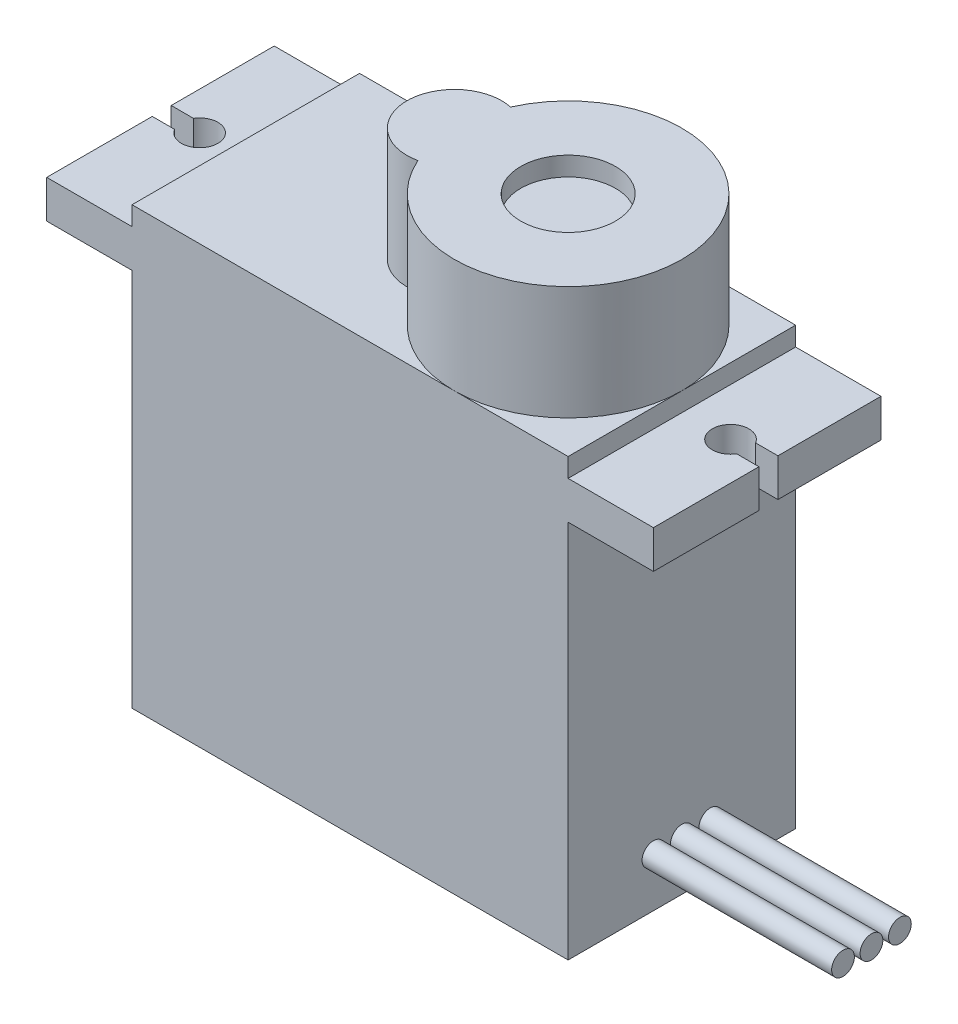
ISO-10303-21;
HEADER;
FILE_DESCRIPTION(('STEP AP214'),'2;1');
FILE_NAME('part.step','',(''),(''),'','','');
FILE_SCHEMA(('AUTOMOTIVE_DESIGN { 1 0 10303 214 1 1 1 1 }'));
ENDSEC;
DATA;
#1=APPLICATION_CONTEXT('core data for automotive mechanical design processes');
#2=APPLICATION_PROTOCOL_DEFINITION('international standard','automotive_design',2000,#1);
#3=PRODUCT_CONTEXT('',#1,'mechanical');
#4=PRODUCT('Part','Part','',(#3));
#5=PRODUCT_RELATED_PRODUCT_CATEGORY('part','',(#4));
#6=PRODUCT_DEFINITION_FORMATION('','',#4);
#7=PRODUCT_DEFINITION_CONTEXT('part definition',#1,'design');
#8=PRODUCT_DEFINITION('design','',#6,#7);
#9=PRODUCT_DEFINITION_SHAPE('','',#8);
#10=(LENGTH_UNIT() NAMED_UNIT(*) SI_UNIT(.MILLI.,.METRE.));
#11=(NAMED_UNIT(*) PLANE_ANGLE_UNIT() SI_UNIT($,.RADIAN.));
#12=(NAMED_UNIT(*) SI_UNIT($,.STERADIAN.) SOLID_ANGLE_UNIT());
#13=UNCERTAINTY_MEASURE_WITH_UNIT(LENGTH_MEASURE(1.E-05),#10,'distance_accuracy_value','');
#14=(GEOMETRIC_REPRESENTATION_CONTEXT(3) GLOBAL_UNCERTAINTY_ASSIGNED_CONTEXT((#13)) GLOBAL_UNIT_ASSIGNED_CONTEXT((#10,
#11,#12)) REPRESENTATION_CONTEXT('',''));
#15=CARTESIAN_POINT('',(0.,0.,0.));
#16=DIRECTION('',(0.,0.,1.));
#17=DIRECTION('',(1.,0.,0.));
#18=AXIS2_PLACEMENT_3D('',#15,#16,#17);
#19=CARTESIAN_POINT('',(16.,10.5,12.));
#20=DIRECTION('',(-1.,0.,0.));
#21=DIRECTION('',(0.,-1.,0.));
#22=AXIS2_PLACEMENT_3D('',#19,#20,#21);
#23=PLANE('',#22);
#24=DIRECTION('',(0.,0.,-1.));
#25=VECTOR('',#24,1.);
#26=CARTESIAN_POINT('',(16.,8.5,12.));
#27=LINE('',#26,#25);
#28=CARTESIAN_POINT('',(16.,8.5,12.));
#29=VERTEX_POINT('',#28);
#30=CARTESIAN_POINT('',(16.,8.5,6.43335559913665));
#31=VERTEX_POINT('',#30);
#32=EDGE_CURVE('E244',#29,#31,#27,.T.);
#33=ORIENTED_EDGE('',*,*,#32,.T.);
#34=DIRECTION('',(0.,1.,0.));
#35=VECTOR('',#34,1.);
#36=CARTESIAN_POINT('',(16.,5.5,6.43335559913665));
#37=LINE('',#36,#35);
#38=CARTESIAN_POINT('',(16.,10.5,6.43335559913665));
#39=VERTEX_POINT('',#38);
#40=EDGE_CURVE('E216',#31,#39,#37,.T.);
#41=ORIENTED_EDGE('',*,*,#40,.T.);
#42=DIRECTION('',(0.,0.,-1.));
#43=VECTOR('',#42,1.);
#44=CARTESIAN_POINT('',(16.,10.5,12.));
#45=LINE('',#44,#43);
#46=CARTESIAN_POINT('',(16.,10.5,12.));
#47=VERTEX_POINT('',#46);
#48=EDGE_CURVE('E240',#47,#39,#45,.T.);
#49=ORIENTED_EDGE('',*,*,#48,.F.);
#50=DIRECTION('',(0.,1.,0.));
#51=VECTOR('',#50,1.);
#52=CARTESIAN_POINT('',(16.,10.5,12.));
#53=LINE('',#52,#51);
#54=EDGE_CURVE('E354',#29,#47,#53,.T.);
#55=ORIENTED_EDGE('',*,*,#54,.F.);
#56=EDGE_LOOP('',(#33,#41,#49,#55));
#57=FACE_BOUND('',#56,.T.);
#58=ADVANCED_FACE('F36',(#57),#23,.F.);
#59=CARTESIAN_POINT('',(-16.,10.5,12.));
#60=DIRECTION('',(1.,0.,0.));
#61=DIRECTION('',(0.,1.,0.));
#62=AXIS2_PLACEMENT_3D('',#59,#60,#61);
#63=PLANE('',#62);
#64=DIRECTION('',(0.,0.,-1.));
#65=VECTOR('',#64,1.);
#66=CARTESIAN_POINT('',(-16.,8.5,12.));
#67=LINE('',#66,#65);
#68=CARTESIAN_POINT('',(-16.,8.5,5.43335559913665));
#69=VERTEX_POINT('',#68);
#70=CARTESIAN_POINT('',(-16.,8.5,0.));
#71=VERTEX_POINT('',#70);
#72=EDGE_CURVE('E327',#69,#71,#67,.T.);
#73=ORIENTED_EDGE('',*,*,#72,.F.);
#74=DIRECTION('',(0.,1.,0.));
#75=VECTOR('',#74,1.);
#76=CARTESIAN_POINT('',(-16.,5.49999999999999,5.43335559913665));
#77=LINE('',#76,#75);
#78=CARTESIAN_POINT('',(-16.,10.5,5.43335559913665));
#79=VERTEX_POINT('',#78);
#80=EDGE_CURVE('E382',#69,#79,#77,.T.);
#81=ORIENTED_EDGE('',*,*,#80,.T.);
#82=DIRECTION('',(0.,0.,-1.));
#83=VECTOR('',#82,1.);
#84=CARTESIAN_POINT('',(-16.,10.5,12.));
#85=LINE('',#84,#83);
#86=CARTESIAN_POINT('',(-16.,10.5,0.));
#87=VERTEX_POINT('',#86);
#88=EDGE_CURVE('E221',#79,#87,#85,.T.);
#89=ORIENTED_EDGE('',*,*,#88,.T.);
#90=DIRECTION('',(0.,-1.,0.));
#91=VECTOR('',#90,1.);
#92=CARTESIAN_POINT('',(-16.,10.5,0.));
#93=LINE('',#92,#91);
#94=EDGE_CURVE('E312',#87,#71,#93,.T.);
#95=ORIENTED_EDGE('',*,*,#94,.T.);
#96=EDGE_LOOP('',(#73,#81,#89,#95));
#97=FACE_BOUND('',#96,.T.);
#98=ADVANCED_FACE('F475',(#97),#63,.F.);
#99=CARTESIAN_POINT('',(-11.5,11.5,12.));
#100=DIRECTION('',(0.,-1.,0.));
#101=DIRECTION('',(0.,0.,-1.));
#102=AXIS2_PLACEMENT_3D('',#99,#100,#101);
#103=PLANE('',#102);
#104=CARTESIAN_POINT('',(-0.499999999999998,11.5,6.));
#105=DIRECTION('',(0.,1.,0.));
#106=DIRECTION('',(0.,0.,1.));
#107=AXIS2_PLACEMENT_3D('',#104,#105,#106);
#108=CIRCLE('',#107,2.5);
#109=CARTESIAN_POINT('',(0.0208333333333371,11.5,3.55485529285301));
#110=VERTEX_POINT('',#109);
#111=CARTESIAN_POINT('',(0.0208333333333336,11.5,8.44514470714698));
#112=VERTEX_POINT('',#111);
#113=EDGE_CURVE('E367',#110,#112,#108,.T.);
#114=ORIENTED_EDGE('',*,*,#113,.F.);
#115=CARTESIAN_POINT('',(5.50000000000001,11.5,6.));
#116=DIRECTION('',(0.,1.,0.));
#117=DIRECTION('',(0.,0.,1.));
#118=AXIS2_PLACEMENT_3D('',#115,#116,#117);
#119=CIRCLE('',#118,6.);
#120=CARTESIAN_POINT('',(5.50000000000001,11.5,0.));
#121=VERTEX_POINT('',#120);
#122=EDGE_CURVE('E250',#121,#110,#119,.T.);
#123=ORIENTED_EDGE('',*,*,#122,.F.);
#124=DIRECTION('',(-1.,0.,0.));
#125=VECTOR('',#124,1.);
#126=CARTESIAN_POINT('',(-11.5,11.5,0.));
#127=LINE('',#126,#125);
#128=CARTESIAN_POINT('',(-11.5,11.5,0.));
#129=VERTEX_POINT('',#128);
#130=EDGE_CURVE('E303',#121,#129,#127,.T.);
#131=ORIENTED_EDGE('',*,*,#130,.T.);
#132=DIRECTION('',(0.,0.,-1.));
#133=VECTOR('',#132,1.);
#134=CARTESIAN_POINT('',(-11.5,11.5,12.));
#135=LINE('',#134,#133);
#136=CARTESIAN_POINT('',(-11.5,11.5,12.));
#137=VERTEX_POINT('',#136);
#138=EDGE_CURVE('E224',#137,#129,#135,.T.);
#139=ORIENTED_EDGE('',*,*,#138,.F.);
#140=DIRECTION('',(-1.,0.,0.));
#141=VECTOR('',#140,1.);
#142=CARTESIAN_POINT('',(-11.5,11.5,12.));
#143=LINE('',#142,#141);
#144=CARTESIAN_POINT('',(5.50000000000001,11.5,12.));
#145=VERTEX_POINT('',#144);
#146=EDGE_CURVE('E349',#145,#137,#143,.T.);
#147=ORIENTED_EDGE('',*,*,#146,.F.);
#148=EDGE_CURVE('E363',#112,#145,#119,.T.);
#149=ORIENTED_EDGE('',*,*,#148,.F.);
#150=EDGE_LOOP('',(#114,#123,#131,#139,#147,#149));
#151=FACE_BOUND('',#150,.T.);
#152=ADVANCED_FACE('F452',(#151),#103,.F.);
#153=CARTESIAN_POINT('',(11.5,11.5,6.));
#154=VERTEX_POINT('',#153);
#155=EDGE_CURVE('E253',#145,#154,#119,.T.);
#156=ORIENTED_EDGE('',*,*,#155,.F.);
#157=CARTESIAN_POINT('',(11.5,11.5,12.));
#158=VERTEX_POINT('',#157);
#159=EDGE_CURVE('E346',#158,#145,#143,.T.);
#160=ORIENTED_EDGE('',*,*,#159,.F.);
#161=DIRECTION('',(0.,0.,-1.));
#162=VECTOR('',#161,1.);
#163=CARTESIAN_POINT('',(11.5,11.5,12.));
#164=LINE('',#163,#162);
#165=EDGE_CURVE('E233',#158,#154,#164,.T.);
#166=ORIENTED_EDGE('',*,*,#165,.T.);
#167=EDGE_LOOP('',(#156,#160,#166));
#168=FACE_BOUND('',#167,.T.);
#169=ADVANCED_FACE('F269',(#168),#103,.F.);
#170=CARTESIAN_POINT('',(11.5,8.5,12.));
#171=DIRECTION('',(-1.,0.,0.));
#172=DIRECTION('',(0.,-1.,0.));
#173=AXIS2_PLACEMENT_3D('',#170,#171,#172);
#174=PLANE('',#173);
#175=CARTESIAN_POINT('',(11.5,-8.9,4.5));
#176=DIRECTION('',(-1.,0.,0.));
#177=DIRECTION('',(0.,-1.,0.));
#178=AXIS2_PLACEMENT_3D('',#175,#176,#177);
#179=CIRCLE('',#178,0.6);
#180=CARTESIAN_POINT('',(11.5,-9.5,4.5));
#181=VERTEX_POINT('',#180);
#182=EDGE_CURVE('E11',#181,#181,#179,.F.);
#183=ORIENTED_EDGE('',*,*,#182,.F.);
#184=EDGE_LOOP('',(#183));
#185=FACE_BOUND('',#184,.T.);
#186=CARTESIAN_POINT('',(11.5,-8.9,7.5));
#187=DIRECTION('',(-1.,0.,0.));
#188=DIRECTION('',(0.,-1.,0.));
#189=AXIS2_PLACEMENT_3D('',#186,#187,#188);
#190=CIRCLE('',#189,0.6);
#191=CARTESIAN_POINT('',(11.5,-9.5,7.5));
#192=VERTEX_POINT('',#191);
#193=EDGE_CURVE('E44',#192,#192,#190,.F.);
#194=ORIENTED_EDGE('',*,*,#193,.F.);
#195=EDGE_LOOP('',(#194));
#196=FACE_BOUND('',#195,.T.);
#197=CARTESIAN_POINT('',(11.5,-8.9,6.));
#198=DIRECTION('',(-1.,0.,0.));
#199=DIRECTION('',(0.,-1.,0.));
#200=AXIS2_PLACEMENT_3D('',#197,#198,#199);
#201=CIRCLE('',#200,0.6);
#202=CARTESIAN_POINT('',(11.5,-9.5,6.));
#203=VERTEX_POINT('',#202);
#204=EDGE_CURVE('E259',#203,#203,#201,.F.);
#205=ORIENTED_EDGE('',*,*,#204,.F.);
#206=EDGE_LOOP('',(#205));
#207=FACE_BOUND('',#206,.T.);
#208=DIRECTION('',(0.,1.,0.));
#209=VECTOR('',#208,1.);
#210=CARTESIAN_POINT('',(11.5,8.5,0.));
#211=LINE('',#210,#209);
#212=CARTESIAN_POINT('',(11.5,-11.5,0.));
#213=VERTEX_POINT('',#212);
#214=CARTESIAN_POINT('',(11.5,8.5,0.));
#215=VERTEX_POINT('',#214);
#216=EDGE_CURVE('E277',#213,#215,#211,.T.);
#217=ORIENTED_EDGE('',*,*,#216,.T.);
#218=DIRECTION('',(0.,0.,-1.));
#219=VECTOR('',#218,1.);
#220=CARTESIAN_POINT('',(11.5,8.5,12.));
#221=LINE('',#220,#219);
#222=CARTESIAN_POINT('',(11.5,8.5,12.));
#223=VERTEX_POINT('',#222);
#224=EDGE_CURVE('E247',#223,#215,#221,.T.);
#225=ORIENTED_EDGE('',*,*,#224,.F.);
#226=DIRECTION('',(0.,1.,0.));
#227=VECTOR('',#226,1.);
#228=CARTESIAN_POINT('',(11.5,8.5,12.));
#229=LINE('',#228,#227);
#230=CARTESIAN_POINT('',(11.5,-11.5,12.));
#231=VERTEX_POINT('',#230);
#232=EDGE_CURVE('E321',#231,#223,#229,.T.);
#233=ORIENTED_EDGE('',*,*,#232,.F.);
#234=DIRECTION('',(0.,0.,-1.));
#235=VECTOR('',#234,1.);
#236=CARTESIAN_POINT('',(11.5,-11.5,12.));
#237=LINE('',#236,#235);
#238=EDGE_CURVE('E280',#231,#213,#237,.T.);
#239=ORIENTED_EDGE('',*,*,#238,.T.);
#240=EDGE_LOOP('',(#217,#225,#233,#239));
#241=FACE_BOUND('',#240,.T.);
#242=ADVANCED_FACE('F38',(#185,#196,#207,#241),#174,.F.);
#243=CARTESIAN_POINT('',(11.5,8.5,12.));
#244=DIRECTION('',(0.,1.,0.));
#245=DIRECTION('',(0.,0.,1.));
#246=AXIS2_PLACEMENT_3D('',#243,#244,#245);
#247=PLANE('',#246);
#248=CARTESIAN_POINT('',(14.,8.5,5.93335559913665));
#249=DIRECTION('',(0.,1.,0.));
#250=DIRECTION('',(0.,0.,1.));
#251=AXIS2_PLACEMENT_3D('',#248,#249,#250);
#252=CIRCLE('',#251,0.963801910648769);
#253=CARTESIAN_POINT('',(14.8239624524032,8.5,5.43335559913665));
#254=VERTEX_POINT('',#253);
#255=CARTESIAN_POINT('',(14.8239624524032,8.5,6.43335559913665));
#256=VERTEX_POINT('',#255);
#257=EDGE_CURVE('E376',#254,#256,#252,.T.);
#258=ORIENTED_EDGE('',*,*,#257,.T.);
#259=DIRECTION('',(1.,0.,0.));
#260=VECTOR('',#259,1.);
#261=CARTESIAN_POINT('',(11.5,8.5,6.43335559913665));
#262=LINE('',#261,#260);
#263=EDGE_CURVE('E370',#256,#31,#262,.T.);
#264=ORIENTED_EDGE('',*,*,#263,.T.);
#265=ORIENTED_EDGE('',*,*,#32,.F.);
#266=DIRECTION('',(1.,0.,0.));
#267=VECTOR('',#266,1.);
#268=CARTESIAN_POINT('',(11.5,8.5,12.));
#269=LINE('',#268,#267);
#270=EDGE_CURVE('E356',#223,#29,#269,.T.);
#271=ORIENTED_EDGE('',*,*,#270,.F.);
#272=ORIENTED_EDGE('',*,*,#224,.T.);
#273=DIRECTION('',(1.,0.,0.));
#274=VECTOR('',#273,1.);
#275=CARTESIAN_POINT('',(11.5,8.5,0.));
#276=LINE('',#275,#274);
#277=CARTESIAN_POINT('',(16.,8.5,0.));
#278=VERTEX_POINT('',#277);
#279=EDGE_CURVE('E283',#215,#278,#276,.T.);
#280=ORIENTED_EDGE('',*,*,#279,.T.);
#281=CARTESIAN_POINT('',(16.,8.5,5.43335559913665));
#282=VERTEX_POINT('',#281);
#283=EDGE_CURVE('E243',#282,#278,#27,.T.);
#284=ORIENTED_EDGE('',*,*,#283,.F.);
#285=DIRECTION('',(-1.,0.,0.));
#286=VECTOR('',#285,1.);
#287=CARTESIAN_POINT('',(11.5,8.5,5.43335559913666));
#288=LINE('',#287,#286);
#289=EDGE_CURVE('E379',#282,#254,#288,.T.);
#290=ORIENTED_EDGE('',*,*,#289,.T.);
#291=EDGE_LOOP('',(#258,#264,#265,#271,#272,#280,#284,#290));
#292=FACE_BOUND('',#291,.T.);
#293=ADVANCED_FACE('F268',(#292),#247,.F.);
#294=CARTESIAN_POINT('',(16.,10.5,5.43335559913665));
#295=VERTEX_POINT('',#294);
#296=CARTESIAN_POINT('',(16.,10.5,0.));
#297=VERTEX_POINT('',#296);
#298=EDGE_CURVE('E239',#295,#297,#45,.T.);
#299=ORIENTED_EDGE('',*,*,#298,.F.);
#300=DIRECTION('',(0.,1.,0.));
#301=VECTOR('',#300,1.);
#302=CARTESIAN_POINT('',(16.,5.5,5.43335559913665));
#303=LINE('',#302,#301);
#304=EDGE_CURVE('E51',#282,#295,#303,.T.);
#305=ORIENTED_EDGE('',*,*,#304,.F.);
#306=ORIENTED_EDGE('',*,*,#283,.T.);
#307=DIRECTION('',(0.,1.,0.));
#308=VECTOR('',#307,1.);
#309=CARTESIAN_POINT('',(16.,10.5,0.));
#310=LINE('',#309,#308);
#311=EDGE_CURVE('E287',#278,#297,#310,.T.);
#312=ORIENTED_EDGE('',*,*,#311,.T.);
#313=EDGE_LOOP('',(#299,#305,#306,#312));
#314=FACE_BOUND('',#313,.T.);
#315=ADVANCED_FACE('F492',(#314),#23,.F.);
#316=CARTESIAN_POINT('',(11.5,10.5,12.));
#317=DIRECTION('',(0.,-1.,0.));
#318=DIRECTION('',(1.,0.,0.));
#319=AXIS2_PLACEMENT_3D('',#316,#317,#318);
#320=PLANE('',#319);
#321=ORIENTED_EDGE('',*,*,#48,.T.);
#322=DIRECTION('',(1.,0.,0.));
#323=VECTOR('',#322,1.);
#324=CARTESIAN_POINT('',(16.,10.5,6.43335559913665));
#325=LINE('',#324,#323);
#326=CARTESIAN_POINT('',(14.8239624524032,10.5,6.43335559913665));
#327=VERTEX_POINT('',#326);
#328=EDGE_CURVE('E385',#327,#39,#325,.T.);
#329=ORIENTED_EDGE('',*,*,#328,.F.);
#330=CARTESIAN_POINT('',(14.,10.5,5.93335559913665));
#331=DIRECTION('',(0.,1.,0.));
#332=DIRECTION('',(-1.,0.,0.));
#333=AXIS2_PLACEMENT_3D('',#330,#331,#332);
#334=CIRCLE('',#333,0.963801910648769);
#335=CARTESIAN_POINT('',(14.8239624524032,10.5,5.43335559913665));
#336=VERTEX_POINT('',#335);
#337=EDGE_CURVE('E392',#336,#327,#334,.T.);
#338=ORIENTED_EDGE('',*,*,#337,.F.);
#339=DIRECTION('',(-1.,0.,0.));
#340=VECTOR('',#339,1.);
#341=CARTESIAN_POINT('',(16.,10.5,5.43335559913665));
#342=LINE('',#341,#340);
#343=EDGE_CURVE('E395',#295,#336,#342,.T.);
#344=ORIENTED_EDGE('',*,*,#343,.F.);
#345=ORIENTED_EDGE('',*,*,#298,.T.);
#346=DIRECTION('',(-1.,0.,0.));
#347=VECTOR('',#346,1.);
#348=CARTESIAN_POINT('',(11.5,10.5,0.));
#349=LINE('',#348,#347);
#350=CARTESIAN_POINT('',(11.5,10.5,0.));
#351=VERTEX_POINT('',#350);
#352=EDGE_CURVE('E298',#297,#351,#349,.T.);
#353=ORIENTED_EDGE('',*,*,#352,.T.);
#354=DIRECTION('',(0.,0.,-1.));
#355=VECTOR('',#354,1.);
#356=CARTESIAN_POINT('',(11.5,10.5,12.));
#357=LINE('',#356,#355);
#358=CARTESIAN_POINT('',(11.5,10.5,12.));
#359=VERTEX_POINT('',#358);
#360=EDGE_CURVE('E236',#359,#351,#357,.T.);
#361=ORIENTED_EDGE('',*,*,#360,.F.);
#362=DIRECTION('',(-1.,0.,0.));
#363=VECTOR('',#362,1.);
#364=CARTESIAN_POINT('',(11.5,10.5,12.));
#365=LINE('',#364,#363);
#366=EDGE_CURVE('E352',#47,#359,#365,.T.);
#367=ORIENTED_EDGE('',*,*,#366,.F.);
#368=EDGE_LOOP('',(#321,#329,#338,#344,#345,#353,#361,#367));
#369=FACE_BOUND('',#368,.T.);
#370=ADVANCED_FACE('F499',(#369),#320,.F.);
#371=CARTESIAN_POINT('',(11.5,11.5,12.));
#372=DIRECTION('',(-1.,0.,0.));
#373=DIRECTION('',(0.,-1.,0.));
#374=AXIS2_PLACEMENT_3D('',#371,#372,#373);
#375=PLANE('',#374);
#376=DIRECTION('',(0.,1.,0.));
#377=VECTOR('',#376,1.);
#378=CARTESIAN_POINT('',(11.5,11.5,0.));
#379=LINE('',#378,#377);
#380=CARTESIAN_POINT('',(11.5,11.5,0.));
#381=VERTEX_POINT('',#380);
#382=EDGE_CURVE('E300',#351,#381,#379,.T.);
#383=ORIENTED_EDGE('',*,*,#382,.T.);
#384=EDGE_CURVE('E232',#154,#381,#164,.T.);
#385=ORIENTED_EDGE('',*,*,#384,.F.);
#386=ORIENTED_EDGE('',*,*,#165,.F.);
#387=DIRECTION('',(0.,1.,0.));
#388=VECTOR('',#387,1.);
#389=CARTESIAN_POINT('',(11.5,11.5,12.));
#390=LINE('',#389,#388);
#391=EDGE_CURVE('E350',#359,#158,#390,.T.);
#392=ORIENTED_EDGE('',*,*,#391,.F.);
#393=ORIENTED_EDGE('',*,*,#360,.T.);
#394=EDGE_LOOP('',(#383,#385,#386,#392,#393));
#395=FACE_BOUND('',#394,.T.);
#396=ADVANCED_FACE('F460',(#395),#375,.F.);
#397=EDGE_CURVE('E444',#154,#121,#119,.T.);
#398=ORIENTED_EDGE('',*,*,#397,.F.);
#399=ORIENTED_EDGE('',*,*,#384,.T.);
#400=EDGE_CURVE('E304',#381,#121,#127,.T.);
#401=ORIENTED_EDGE('',*,*,#400,.T.);
#402=EDGE_LOOP('',(#398,#399,#401));
#403=FACE_BOUND('',#402,.T.);
#404=ADVANCED_FACE('F464',(#403),#103,.F.);
#405=CARTESIAN_POINT('',(-11.5,11.5,12.));
#406=DIRECTION('',(1.,0.,0.));
#407=DIRECTION('',(0.,0.,-1.));
#408=AXIS2_PLACEMENT_3D('',#405,#406,#407);
#409=PLANE('',#408);
#410=DIRECTION('',(0.,-1.,0.));
#411=VECTOR('',#410,1.);
#412=CARTESIAN_POINT('',(-11.5,11.5,0.));
#413=LINE('',#412,#411);
#414=CARTESIAN_POINT('',(-11.5,10.5,0.));
#415=VERTEX_POINT('',#414);
#416=EDGE_CURVE('E307',#129,#415,#413,.T.);
#417=ORIENTED_EDGE('',*,*,#416,.T.);
#418=DIRECTION('',(0.,0.,-1.));
#419=VECTOR('',#418,1.);
#420=CARTESIAN_POINT('',(-11.5,10.5,12.));
#421=LINE('',#420,#419);
#422=CARTESIAN_POINT('',(-11.5,10.5,12.));
#423=VERTEX_POINT('',#422);
#424=EDGE_CURVE('E220',#423,#415,#421,.T.);
#425=ORIENTED_EDGE('',*,*,#424,.F.);
#426=DIRECTION('',(0.,-1.,0.));
#427=VECTOR('',#426,1.);
#428=CARTESIAN_POINT('',(-11.5,11.5,12.));
#429=LINE('',#428,#427);
#430=EDGE_CURVE('E344',#137,#423,#429,.T.);
#431=ORIENTED_EDGE('',*,*,#430,.F.);
#432=ORIENTED_EDGE('',*,*,#138,.T.);
#433=EDGE_LOOP('',(#417,#425,#431,#432));
#434=FACE_BOUND('',#433,.T.);
#435=ADVANCED_FACE('F470',(#434),#409,.F.);
#436=CARTESIAN_POINT('',(-11.5,10.5,12.));
#437=DIRECTION('',(0.,-1.,0.));
#438=DIRECTION('',(1.,0.,0.));
#439=AXIS2_PLACEMENT_3D('',#436,#437,#438);
#440=PLANE('',#439);
#441=ORIENTED_EDGE('',*,*,#88,.F.);
#442=DIRECTION('',(-1.,0.,0.));
#443=VECTOR('',#442,1.);
#444=CARTESIAN_POINT('',(-16.,10.5,5.43335559913665));
#445=LINE('',#444,#443);
#446=CARTESIAN_POINT('',(-14.8239624524032,10.5,5.43335559913665));
#447=VERTEX_POINT('',#446);
#448=EDGE_CURVE('E204',#447,#79,#445,.T.);
#449=ORIENTED_EDGE('',*,*,#448,.F.);
#450=CARTESIAN_POINT('',(-14.,10.5,5.93335559913665));
#451=DIRECTION('',(0.,1.,0.));
#452=DIRECTION('',(1.,0.,0.));
#453=AXIS2_PLACEMENT_3D('',#450,#451,#452);
#454=CIRCLE('',#453,0.963801910648769);
#455=CARTESIAN_POINT('',(-14.8239624524032,10.5,6.43335559913665));
#456=VERTEX_POINT('',#455);
#457=EDGE_CURVE('E215',#456,#447,#454,.T.);
#458=ORIENTED_EDGE('',*,*,#457,.F.);
#459=DIRECTION('',(1.,0.,0.));
#460=VECTOR('',#459,1.);
#461=CARTESIAN_POINT('',(-16.,10.5,6.43335559913665));
#462=LINE('',#461,#460);
#463=CARTESIAN_POINT('',(-16.,10.5,6.43335559913665));
#464=VERTEX_POINT('',#463);
#465=EDGE_CURVE('E196',#464,#456,#462,.T.);
#466=ORIENTED_EDGE('',*,*,#465,.F.);
#467=CARTESIAN_POINT('',(-16.,10.5,12.));
#468=VERTEX_POINT('',#467);
#469=EDGE_CURVE('E211',#468,#464,#85,.T.);
#470=ORIENTED_EDGE('',*,*,#469,.F.);
#471=DIRECTION('',(-1.,0.,0.));
#472=VECTOR('',#471,1.);
#473=CARTESIAN_POINT('',(-11.5,10.5,12.));
#474=LINE('',#473,#472);
#475=EDGE_CURVE('E340',#423,#468,#474,.T.);
#476=ORIENTED_EDGE('',*,*,#475,.F.);
#477=ORIENTED_EDGE('',*,*,#424,.T.);
#478=DIRECTION('',(-1.,0.,0.));
#479=VECTOR('',#478,1.);
#480=CARTESIAN_POINT('',(-11.5,10.5,0.));
#481=LINE('',#480,#479);
#482=EDGE_CURVE('E309',#415,#87,#481,.T.);
#483=ORIENTED_EDGE('',*,*,#482,.T.);
#484=EDGE_LOOP('',(#441,#449,#458,#466,#470,#476,#477,#483));
#485=FACE_BOUND('',#484,.T.);
#486=ADVANCED_FACE('F209',(#485),#440,.F.);
#487=ORIENTED_EDGE('',*,*,#469,.T.);
#488=DIRECTION('',(0.,1.,0.));
#489=VECTOR('',#488,1.);
#490=CARTESIAN_POINT('',(-16.,5.49999999999999,6.43335559913665));
#491=LINE('',#490,#489);
#492=CARTESIAN_POINT('',(-16.,8.5,6.43335559913665));
#493=VERTEX_POINT('',#492);
#494=EDGE_CURVE('E193',#493,#464,#491,.T.);
#495=ORIENTED_EDGE('',*,*,#494,.F.);
#496=CARTESIAN_POINT('',(-16.,8.5,12.));
#497=VERTEX_POINT('',#496);
#498=EDGE_CURVE('E226',#497,#493,#67,.T.);
#499=ORIENTED_EDGE('',*,*,#498,.F.);
#500=DIRECTION('',(0.,-1.,0.));
#501=VECTOR('',#500,1.);
#502=CARTESIAN_POINT('',(-16.,10.5,12.));
#503=LINE('',#502,#501);
#504=EDGE_CURVE('E219',#468,#497,#503,.T.);
#505=ORIENTED_EDGE('',*,*,#504,.F.);
#506=EDGE_LOOP('',(#487,#495,#499,#505));
#507=FACE_BOUND('',#506,.T.);
#508=ADVANCED_FACE('F218',(#507),#63,.F.);
#509=CARTESIAN_POINT('',(-11.5,8.5,12.));
#510=DIRECTION('',(0.,1.,0.));
#511=DIRECTION('',(0.,0.,1.));
#512=AXIS2_PLACEMENT_3D('',#509,#510,#511);
#513=PLANE('',#512);
#514=CARTESIAN_POINT('',(-14.,8.5,5.93335559913665));
#515=DIRECTION('',(0.,1.,0.));
#516=DIRECTION('',(0.,0.,1.));
#517=AXIS2_PLACEMENT_3D('',#514,#515,#516);
#518=CIRCLE('',#517,0.963801910648769);
#519=CARTESIAN_POINT('',(-14.8239624524032,8.5,6.43335559913665));
#520=VERTEX_POINT('',#519);
#521=CARTESIAN_POINT('',(-14.8239624524032,8.5,5.43335559913665));
#522=VERTEX_POINT('',#521);
#523=EDGE_CURVE('E252',#520,#522,#518,.T.);
#524=ORIENTED_EDGE('',*,*,#523,.T.);
#525=DIRECTION('',(-1.,0.,0.));
#526=VECTOR('',#525,1.);
#527=CARTESIAN_POINT('',(-11.5,8.5,5.43335559913666));
#528=LINE('',#527,#526);
#529=EDGE_CURVE('E256',#522,#69,#528,.T.);
#530=ORIENTED_EDGE('',*,*,#529,.T.);
#531=ORIENTED_EDGE('',*,*,#72,.T.);
#532=DIRECTION('',(1.,0.,0.));
#533=VECTOR('',#532,1.);
#534=CARTESIAN_POINT('',(-11.5,8.5,0.));
#535=LINE('',#534,#533);
#536=CARTESIAN_POINT('',(-11.5,8.5,0.));
#537=VERTEX_POINT('',#536);
#538=EDGE_CURVE('E315',#71,#537,#535,.T.);
#539=ORIENTED_EDGE('',*,*,#538,.T.);
#540=DIRECTION('',(0.,0.,-1.));
#541=VECTOR('',#540,1.);
#542=CARTESIAN_POINT('',(-11.5,8.5,12.));
#543=LINE('',#542,#541);
#544=CARTESIAN_POINT('',(-11.5,8.5,12.));
#545=VERTEX_POINT('',#544);
#546=EDGE_CURVE('E325',#545,#537,#543,.T.);
#547=ORIENTED_EDGE('',*,*,#546,.F.);
#548=DIRECTION('',(1.,0.,0.));
#549=VECTOR('',#548,1.);
#550=CARTESIAN_POINT('',(-11.5,8.5,12.));
#551=LINE('',#550,#549);
#552=EDGE_CURVE('E336',#497,#545,#551,.T.);
#553=ORIENTED_EDGE('',*,*,#552,.F.);
#554=ORIENTED_EDGE('',*,*,#498,.T.);
#555=DIRECTION('',(1.,0.,0.));
#556=VECTOR('',#555,1.);
#557=CARTESIAN_POINT('',(-11.5,8.5,6.43335559913665));
#558=LINE('',#557,#556);
#559=EDGE_CURVE('E199',#493,#520,#558,.T.);
#560=ORIENTED_EDGE('',*,*,#559,.T.);
#561=EDGE_LOOP('',(#524,#530,#531,#539,#547,#553,#554,#560));
#562=FACE_BOUND('',#561,.T.);
#563=ADVANCED_FACE('F335',(#562),#513,.F.);
#564=CARTESIAN_POINT('',(-11.5,8.5,12.));
#565=DIRECTION('',(1.,0.,0.));
#566=DIRECTION('',(0.,1.,0.));
#567=AXIS2_PLACEMENT_3D('',#564,#565,#566);
#568=PLANE('',#567);
#569=DIRECTION('',(0.,-1.,0.));
#570=VECTOR('',#569,1.);
#571=CARTESIAN_POINT('',(-11.5,8.5,0.));
#572=LINE('',#571,#570);
#573=CARTESIAN_POINT('',(-11.5,-11.5,0.));
#574=VERTEX_POINT('',#573);
#575=EDGE_CURVE('E317',#537,#574,#572,.T.);
#576=ORIENTED_EDGE('',*,*,#575,.T.);
#577=DIRECTION('',(0.,0.,-1.));
#578=VECTOR('',#577,1.);
#579=CARTESIAN_POINT('',(-11.5,-11.5,12.));
#580=LINE('',#579,#578);
#581=CARTESIAN_POINT('',(-11.5,-11.5,12.));
#582=VERTEX_POINT('',#581);
#583=EDGE_CURVE('E323',#582,#574,#580,.T.);
#584=ORIENTED_EDGE('',*,*,#583,.F.);
#585=DIRECTION('',(0.,-1.,0.));
#586=VECTOR('',#585,1.);
#587=CARTESIAN_POINT('',(-11.5,8.5,12.));
#588=LINE('',#587,#586);
#589=EDGE_CURVE('E338',#545,#582,#588,.T.);
#590=ORIENTED_EDGE('',*,*,#589,.F.);
#591=ORIENTED_EDGE('',*,*,#546,.T.);
#592=EDGE_LOOP('',(#576,#584,#590,#591));
#593=FACE_BOUND('',#592,.T.);
#594=ADVANCED_FACE('F521',(#593),#568,.F.);
#595=CARTESIAN_POINT('',(-11.5,-11.5,12.));
#596=DIRECTION('',(0.,1.,0.));
#597=DIRECTION('',(0.,0.,1.));
#598=AXIS2_PLACEMENT_3D('',#595,#596,#597);
#599=PLANE('',#598);
#600=DIRECTION('',(1.,0.,0.));
#601=VECTOR('',#600,1.);
#602=CARTESIAN_POINT('',(-11.5,-11.5,0.));
#603=LINE('',#602,#601);
#604=EDGE_CURVE('E319',#574,#213,#603,.T.);
#605=ORIENTED_EDGE('',*,*,#604,.T.);
#606=ORIENTED_EDGE('',*,*,#238,.F.);
#607=DIRECTION('',(1.,0.,0.));
#608=VECTOR('',#607,1.);
#609=CARTESIAN_POINT('',(-11.5,-11.5,12.));
#610=LINE('',#609,#608);
#611=EDGE_CURVE('E293',#582,#231,#610,.T.);
#612=ORIENTED_EDGE('',*,*,#611,.F.);
#613=ORIENTED_EDGE('',*,*,#583,.T.);
#614=EDGE_LOOP('',(#605,#606,#612,#613));
#615=FACE_BOUND('',#614,.T.);
#616=ADVANCED_FACE('F520',(#615),#599,.F.);
#617=CARTESIAN_POINT('',(0.,0.,12.));
#618=DIRECTION('',(0.,0.,1.));
#619=DIRECTION('',(1.,0.,0.));
#620=AXIS2_PLACEMENT_3D('',#617,#618,#619);
#621=PLANE('',#620);
#622=ORIENTED_EDGE('',*,*,#232,.T.);
#623=ORIENTED_EDGE('',*,*,#270,.T.);
#624=ORIENTED_EDGE('',*,*,#54,.T.);
#625=ORIENTED_EDGE('',*,*,#366,.T.);
#626=ORIENTED_EDGE('',*,*,#391,.T.);
#627=ORIENTED_EDGE('',*,*,#159,.T.);
#628=ORIENTED_EDGE('',*,*,#146,.T.);
#629=ORIENTED_EDGE('',*,*,#430,.T.);
#630=ORIENTED_EDGE('',*,*,#475,.T.);
#631=ORIENTED_EDGE('',*,*,#504,.T.);
#632=ORIENTED_EDGE('',*,*,#552,.T.);
#633=ORIENTED_EDGE('',*,*,#589,.T.);
#634=ORIENTED_EDGE('',*,*,#611,.T.);
#635=EDGE_LOOP('',(#622,#623,#624,#625,#626,#627,#628,#629,#630,#631,#632,#633,#634));
#636=FACE_BOUND('',#635,.T.);
#637=ADVANCED_FACE('F454',(#636),#621,.T.);
#638=CARTESIAN_POINT('',(0.,0.,0.));
#639=DIRECTION('',(0.,0.,1.));
#640=DIRECTION('',(1.,0.,0.));
#641=AXIS2_PLACEMENT_3D('',#638,#639,#640);
#642=PLANE('',#641);
#643=ORIENTED_EDGE('',*,*,#216,.F.);
#644=ORIENTED_EDGE('',*,*,#604,.F.);
#645=ORIENTED_EDGE('',*,*,#575,.F.);
#646=ORIENTED_EDGE('',*,*,#538,.F.);
#647=ORIENTED_EDGE('',*,*,#94,.F.);
#648=ORIENTED_EDGE('',*,*,#482,.F.);
#649=ORIENTED_EDGE('',*,*,#416,.F.);
#650=ORIENTED_EDGE('',*,*,#130,.F.);
#651=ORIENTED_EDGE('',*,*,#400,.F.);
#652=ORIENTED_EDGE('',*,*,#382,.F.);
#653=ORIENTED_EDGE('',*,*,#352,.F.);
#654=ORIENTED_EDGE('',*,*,#311,.F.);
#655=ORIENTED_EDGE('',*,*,#279,.F.);
#656=EDGE_LOOP('',(#643,#644,#645,#646,#647,#648,#649,#650,#651,#652,#653,#654,#655));
#657=FACE_BOUND('',#656,.T.);
#658=ADVANCED_FACE('F465',(#657),#642,.F.);
#659=CARTESIAN_POINT('',(-0.499999999999998,17.5,6.));
#660=DIRECTION('',(0.,-1.,0.));
#661=DIRECTION('',(0.,0.,-1.));
#662=AXIS2_PLACEMENT_3D('',#659,#660,#661);
#663=CYLINDRICAL_SURFACE('',#662,2.5);
#664=ORIENTED_EDGE('',*,*,#113,.T.);
#665=DIRECTION('',(0.,-1.,0.));
#666=VECTOR('',#665,1.);
#667=CARTESIAN_POINT('',(0.0208333333333336,17.5,8.44514470714698));
#668=LINE('',#667,#666);
#669=CARTESIAN_POINT('',(0.0208333333333336,17.5,8.44514470714698));
#670=VERTEX_POINT('',#669);
#671=EDGE_CURVE('E284',#670,#112,#668,.T.);
#672=ORIENTED_EDGE('',*,*,#671,.F.);
#673=CARTESIAN_POINT('',(-0.499999999999998,17.5,6.));
#674=DIRECTION('',(0.,1.,0.));
#675=DIRECTION('',(0.,0.,1.));
#676=AXIS2_PLACEMENT_3D('',#673,#674,#675);
#677=CIRCLE('',#676,2.5);
#678=CARTESIAN_POINT('',(0.0208333333333371,17.5,3.55485529285301));
#679=VERTEX_POINT('',#678);
#680=EDGE_CURVE('E366',#679,#670,#677,.T.);
#681=ORIENTED_EDGE('',*,*,#680,.F.);
#682=DIRECTION('',(0.,-1.,0.));
#683=VECTOR('',#682,1.);
#684=CARTESIAN_POINT('',(0.0208333333333371,17.5,3.55485529285301));
#685=LINE('',#684,#683);
#686=EDGE_CURVE('E290',#679,#110,#685,.T.);
#687=ORIENTED_EDGE('',*,*,#686,.T.);
#688=EDGE_LOOP('',(#664,#672,#681,#687));
#689=FACE_BOUND('',#688,.T.);
#690=ADVANCED_FACE('F439',(#689),#663,.T.);
#691=CARTESIAN_POINT('',(5.50000000000001,17.5,6.));
#692=DIRECTION('',(0.,-1.,0.));
#693=DIRECTION('',(0.,0.,-1.));
#694=AXIS2_PLACEMENT_3D('',#691,#692,#693);
#695=CYLINDRICAL_SURFACE('',#694,6.);
#696=ORIENTED_EDGE('',*,*,#148,.T.);
#697=ORIENTED_EDGE('',*,*,#155,.T.);
#698=ORIENTED_EDGE('',*,*,#397,.T.);
#699=ORIENTED_EDGE('',*,*,#122,.T.);
#700=ORIENTED_EDGE('',*,*,#686,.F.);
#701=CARTESIAN_POINT('',(5.50000000000001,17.5,6.));
#702=DIRECTION('',(0.,1.,0.));
#703=DIRECTION('',(0.,0.,1.));
#704=AXIS2_PLACEMENT_3D('',#701,#702,#703);
#705=CIRCLE('',#704,6.);
#706=EDGE_CURVE('E362',#670,#679,#705,.T.);
#707=ORIENTED_EDGE('',*,*,#706,.F.);
#708=ORIENTED_EDGE('',*,*,#671,.T.);
#709=EDGE_LOOP('',(#696,#697,#698,#699,#700,#707,#708));
#710=FACE_BOUND('',#709,.T.);
#711=ADVANCED_FACE('F433',(#710),#695,.T.);
#712=CARTESIAN_POINT('',(2.5,17.5,6.));
#713=DIRECTION('',(0.,1.,0.));
#714=DIRECTION('',(0.,0.,1.));
#715=AXIS2_PLACEMENT_3D('',#712,#713,#714);
#716=PLANE('',#715);
#717=CARTESIAN_POINT('',(5.50000000000001,17.5,6.));
#718=DIRECTION('',(0.,1.,0.));
#719=DIRECTION('',(0.,0.,1.));
#720=AXIS2_PLACEMENT_3D('',#717,#718,#719);
#721=CIRCLE('',#720,2.5);
#722=CARTESIAN_POINT('',(5.50000000000001,17.5,8.5));
#723=VERTEX_POINT('',#722);
#724=EDGE_CURVE('E414',#723,#723,#721,.T.);
#725=ORIENTED_EDGE('',*,*,#724,.F.);
#726=EDGE_LOOP('',(#725));
#727=FACE_BOUND('',#726,.T.);
#728=ORIENTED_EDGE('',*,*,#680,.T.);
#729=ORIENTED_EDGE('',*,*,#706,.T.);
#730=EDGE_LOOP('',(#728,#729));
#731=FACE_BOUND('',#730,.T.);
#732=ADVANCED_FACE('F429',(#727,#731),#716,.T.);
#733=CARTESIAN_POINT('',(-16.,5.49999999999999,5.43335559913665));
#734=DIRECTION('',(0.,0.,-1.));
#735=DIRECTION('',(-1.,0.,0.));
#736=AXIS2_PLACEMENT_3D('',#733,#734,#735);
#737=PLANE('',#736);
#738=DIRECTION('',(0.,1.,0.));
#739=VECTOR('',#738,1.);
#740=CARTESIAN_POINT('',(-14.8239624524032,5.49999999999999,5.43335559913665));
#741=LINE('',#740,#739);
#742=EDGE_CURVE('E399',#522,#447,#741,.T.);
#743=ORIENTED_EDGE('',*,*,#742,.T.);
#744=ORIENTED_EDGE('',*,*,#448,.T.);
#745=ORIENTED_EDGE('',*,*,#80,.F.);
#746=ORIENTED_EDGE('',*,*,#529,.F.);
#747=EDGE_LOOP('',(#743,#744,#745,#746));
#748=FACE_BOUND('',#747,.T.);
#749=ADVANCED_FACE('F432',(#748),#737,.F.);
#750=CARTESIAN_POINT('',(-14.,5.49999999999999,5.93335559913665));
#751=DIRECTION('',(0.,1.,0.));
#752=DIRECTION('',(-1.,0.,0.));
#753=AXIS2_PLACEMENT_3D('',#750,#751,#752);
#754=CYLINDRICAL_SURFACE('',#753,0.963801910648769);
#755=DIRECTION('',(0.,1.,0.));
#756=VECTOR('',#755,1.);
#757=CARTESIAN_POINT('',(-14.8239624524032,5.49999999999999,6.43335559913665));
#758=LINE('',#757,#756);
#759=EDGE_CURVE('E59',#520,#456,#758,.T.);
#760=ORIENTED_EDGE('',*,*,#759,.T.);
#761=ORIENTED_EDGE('',*,*,#457,.T.);
#762=ORIENTED_EDGE('',*,*,#742,.F.);
#763=ORIENTED_EDGE('',*,*,#523,.F.);
#764=EDGE_LOOP('',(#760,#761,#762,#763));
#765=FACE_BOUND('',#764,.T.);
#766=ADVANCED_FACE('F479',(#765),#754,.F.);
#767=CARTESIAN_POINT('',(-16.,5.49999999999999,6.43335559913665));
#768=DIRECTION('',(0.,0.,1.));
#769=DIRECTION('',(1.,0.,0.));
#770=AXIS2_PLACEMENT_3D('',#767,#768,#769);
#771=PLANE('',#770);
#772=ORIENTED_EDGE('',*,*,#494,.T.);
#773=ORIENTED_EDGE('',*,*,#465,.T.);
#774=ORIENTED_EDGE('',*,*,#759,.F.);
#775=ORIENTED_EDGE('',*,*,#559,.F.);
#776=EDGE_LOOP('',(#772,#773,#774,#775));
#777=FACE_BOUND('',#776,.T.);
#778=ADVANCED_FACE('F195',(#777),#771,.F.);
#779=CARTESIAN_POINT('',(16.,5.5,6.43335559913665));
#780=DIRECTION('',(0.,0.,1.));
#781=DIRECTION('',(1.,0.,0.));
#782=AXIS2_PLACEMENT_3D('',#779,#780,#781);
#783=PLANE('',#782);
#784=DIRECTION('',(0.,1.,0.));
#785=VECTOR('',#784,1.);
#786=CARTESIAN_POINT('',(14.8239624524032,5.5,6.43335559913665));
#787=LINE('',#786,#785);
#788=EDGE_CURVE('E387',#256,#327,#787,.T.);
#789=ORIENTED_EDGE('',*,*,#788,.T.);
#790=ORIENTED_EDGE('',*,*,#328,.T.);
#791=ORIENTED_EDGE('',*,*,#40,.F.);
#792=ORIENTED_EDGE('',*,*,#263,.F.);
#793=EDGE_LOOP('',(#789,#790,#791,#792));
#794=FACE_BOUND('',#793,.T.);
#795=ADVANCED_FACE('F486',(#794),#783,.F.);
#796=CARTESIAN_POINT('',(14.,5.5,5.93335559913665));
#797=DIRECTION('',(0.,1.,0.));
#798=DIRECTION('',(-1.,0.,0.));
#799=AXIS2_PLACEMENT_3D('',#796,#797,#798);
#800=CYLINDRICAL_SURFACE('',#799,0.963801910648769);
#801=DIRECTION('',(0.,1.,0.));
#802=VECTOR('',#801,1.);
#803=CARTESIAN_POINT('',(14.8239624524032,5.5,5.43335559913665));
#804=LINE('',#803,#802);
#805=EDGE_CURVE('E384',#254,#336,#804,.T.);
#806=ORIENTED_EDGE('',*,*,#805,.T.);
#807=ORIENTED_EDGE('',*,*,#337,.T.);
#808=ORIENTED_EDGE('',*,*,#788,.F.);
#809=ORIENTED_EDGE('',*,*,#257,.F.);
#810=EDGE_LOOP('',(#806,#807,#808,#809));
#811=FACE_BOUND('',#810,.T.);
#812=ADVANCED_FACE('F593',(#811),#800,.F.);
#813=CARTESIAN_POINT('',(16.,5.5,5.43335559913665));
#814=DIRECTION('',(0.,0.,-1.));
#815=DIRECTION('',(-1.,0.,0.));
#816=AXIS2_PLACEMENT_3D('',#813,#814,#815);
#817=PLANE('',#816);
#818=ORIENTED_EDGE('',*,*,#304,.T.);
#819=ORIENTED_EDGE('',*,*,#343,.T.);
#820=ORIENTED_EDGE('',*,*,#805,.F.);
#821=ORIENTED_EDGE('',*,*,#289,.F.);
#822=EDGE_LOOP('',(#818,#819,#820,#821));
#823=FACE_BOUND('',#822,.T.);
#824=ADVANCED_FACE('F513',(#823),#817,.F.);
#825=CARTESIAN_POINT('',(21.5,-8.90000000000001,6.));
#826=DIRECTION('',(-1.,0.,0.));
#827=DIRECTION('',(0.,-1.,0.));
#828=AXIS2_PLACEMENT_3D('',#825,#826,#827);
#829=CYLINDRICAL_SURFACE('',#828,0.6);
#830=CARTESIAN_POINT('',(21.5,-8.90000000000001,6.));
#831=DIRECTION('',(1.,0.,0.));
#832=DIRECTION('',(0.,1.,0.));
#833=AXIS2_PLACEMENT_3D('',#830,#831,#832);
#834=CIRCLE('',#833,0.6);
#835=CARTESIAN_POINT('',(21.5,-8.30000000000001,6.));
#836=VERTEX_POINT('',#835);
#837=EDGE_CURVE('E396',#836,#836,#834,.T.);
#838=ORIENTED_EDGE('',*,*,#837,.F.);
#839=EDGE_LOOP('',(#838));
#840=FACE_BOUND('',#839,.T.);
#841=ORIENTED_EDGE('',*,*,#204,.T.);
#842=EDGE_LOOP('',(#841));
#843=FACE_BOUND('',#842,.T.);
#844=ADVANCED_FACE('F611',(#840,#843),#829,.T.);
#845=CARTESIAN_POINT('',(21.5,-8.90000000000001,6.));
#846=DIRECTION('',(1.,0.,0.));
#847=DIRECTION('',(0.,1.,0.));
#848=AXIS2_PLACEMENT_3D('',#845,#846,#847);
#849=PLANE('',#848);
#850=ORIENTED_EDGE('',*,*,#837,.T.);
#851=EDGE_LOOP('',(#850));
#852=FACE_BOUND('',#851,.T.);
#853=ADVANCED_FACE('F628',(#852),#849,.T.);
#854=CARTESIAN_POINT('',(21.5,-8.90000000000001,7.5));
#855=DIRECTION('',(-1.,0.,0.));
#856=DIRECTION('',(0.,-1.,0.));
#857=AXIS2_PLACEMENT_3D('',#854,#855,#856);
#858=CYLINDRICAL_SURFACE('',#857,0.6);
#859=CARTESIAN_POINT('',(21.5,-8.90000000000001,7.5));
#860=DIRECTION('',(1.,0.,0.));
#861=DIRECTION('',(0.,1.,0.));
#862=AXIS2_PLACEMENT_3D('',#859,#860,#861);
#863=CIRCLE('',#862,0.6);
#864=CARTESIAN_POINT('',(21.5,-8.30000000000001,7.5));
#865=VERTEX_POINT('',#864);
#866=EDGE_CURVE('E407',#865,#865,#863,.T.);
#867=ORIENTED_EDGE('',*,*,#866,.F.);
#868=EDGE_LOOP('',(#867));
#869=FACE_BOUND('',#868,.T.);
#870=ORIENTED_EDGE('',*,*,#193,.T.);
#871=EDGE_LOOP('',(#870));
#872=FACE_BOUND('',#871,.T.);
#873=ADVANCED_FACE('F264',(#869,#872),#858,.T.);
#874=CARTESIAN_POINT('',(21.5,-8.90000000000001,7.5));
#875=DIRECTION('',(1.,0.,0.));
#876=DIRECTION('',(0.,1.,0.));
#877=AXIS2_PLACEMENT_3D('',#874,#875,#876);
#878=PLANE('',#877);
#879=ORIENTED_EDGE('',*,*,#866,.T.);
#880=EDGE_LOOP('',(#879));
#881=FACE_BOUND('',#880,.T.);
#882=ADVANCED_FACE('F647',(#881),#878,.T.);
#883=CARTESIAN_POINT('',(21.5,-8.90000000000001,4.5));
#884=DIRECTION('',(-1.,0.,0.));
#885=DIRECTION('',(0.,-1.,0.));
#886=AXIS2_PLACEMENT_3D('',#883,#884,#885);
#887=CYLINDRICAL_SURFACE('',#886,0.6);
#888=CARTESIAN_POINT('',(21.5,-8.90000000000001,4.5));
#889=DIRECTION('',(1.,0.,0.));
#890=DIRECTION('',(0.,1.,0.));
#891=AXIS2_PLACEMENT_3D('',#888,#889,#890);
#892=CIRCLE('',#891,0.6);
#893=CARTESIAN_POINT('',(21.5,-8.30000000000001,4.5));
#894=VERTEX_POINT('',#893);
#895=EDGE_CURVE('E410',#894,#894,#892,.T.);
#896=ORIENTED_EDGE('',*,*,#895,.F.);
#897=EDGE_LOOP('',(#896));
#898=FACE_BOUND('',#897,.T.);
#899=ORIENTED_EDGE('',*,*,#182,.T.);
#900=EDGE_LOOP('',(#899));
#901=FACE_BOUND('',#900,.T.);
#902=ADVANCED_FACE('F657',(#898,#901),#887,.T.);
#903=CARTESIAN_POINT('',(21.5,-8.90000000000001,4.5));
#904=DIRECTION('',(1.,0.,0.));
#905=DIRECTION('',(0.,1.,0.));
#906=AXIS2_PLACEMENT_3D('',#903,#904,#905);
#907=PLANE('',#906);
#908=ORIENTED_EDGE('',*,*,#895,.T.);
#909=EDGE_LOOP('',(#908));
#910=FACE_BOUND('',#909,.T.);
#911=ADVANCED_FACE('F425',(#910),#907,.T.);
#912=CARTESIAN_POINT('',(5.50000000000001,16.5,6.));
#913=DIRECTION('',(0.,1.,0.));
#914=DIRECTION('',(0.,0.,1.));
#915=AXIS2_PLACEMENT_3D('',#912,#913,#914);
#916=CYLINDRICAL_SURFACE('',#915,2.5);
#917=CARTESIAN_POINT('',(5.50000000000001,16.5,6.));
#918=DIRECTION('',(0.,1.,0.));
#919=DIRECTION('',(0.,0.,1.));
#920=AXIS2_PLACEMENT_3D('',#917,#918,#919);
#921=CIRCLE('',#920,2.5);
#922=CARTESIAN_POINT('',(5.50000000000001,16.5,8.5));
#923=VERTEX_POINT('',#922);
#924=EDGE_CURVE('E413',#923,#923,#921,.T.);
#925=ORIENTED_EDGE('',*,*,#924,.F.);
#926=EDGE_LOOP('',(#925));
#927=FACE_BOUND('',#926,.T.);
#928=ORIENTED_EDGE('',*,*,#724,.T.);
#929=EDGE_LOOP('',(#928));
#930=FACE_BOUND('',#929,.T.);
#931=ADVANCED_FACE('F422',(#927,#930),#916,.F.);
#932=CARTESIAN_POINT('',(5.50000000000001,16.5,6.));
#933=DIRECTION('',(0.,1.,0.));
#934=DIRECTION('',(0.,0.,1.));
#935=AXIS2_PLACEMENT_3D('',#932,#933,#934);
#936=PLANE('',#935);
#937=ORIENTED_EDGE('',*,*,#924,.T.);
#938=EDGE_LOOP('',(#937));
#939=FACE_BOUND('',#938,.T.);
#940=ADVANCED_FACE('F420',(#939),#936,.T.);
#941=CLOSED_SHELL('',(#58,#98,#152,#169,#242,#293,#315,#370,#396,#404,#435,#486,#508,#563,#594,
#616,#637,#658,#690,#711,#732,#749,#766,#778,#795,#812,#824,#844,#853,#873,#882,#902,#911,#931,#940));
#942=MANIFOLD_SOLID_BREP('B2',#941);
#943=ADVANCED_BREP_SHAPE_REPRESENTATION('',(#18,#942),#14);
#944=SHAPE_DEFINITION_REPRESENTATION(#9,#943);
ENDSEC;
END-ISO-10303-21;
